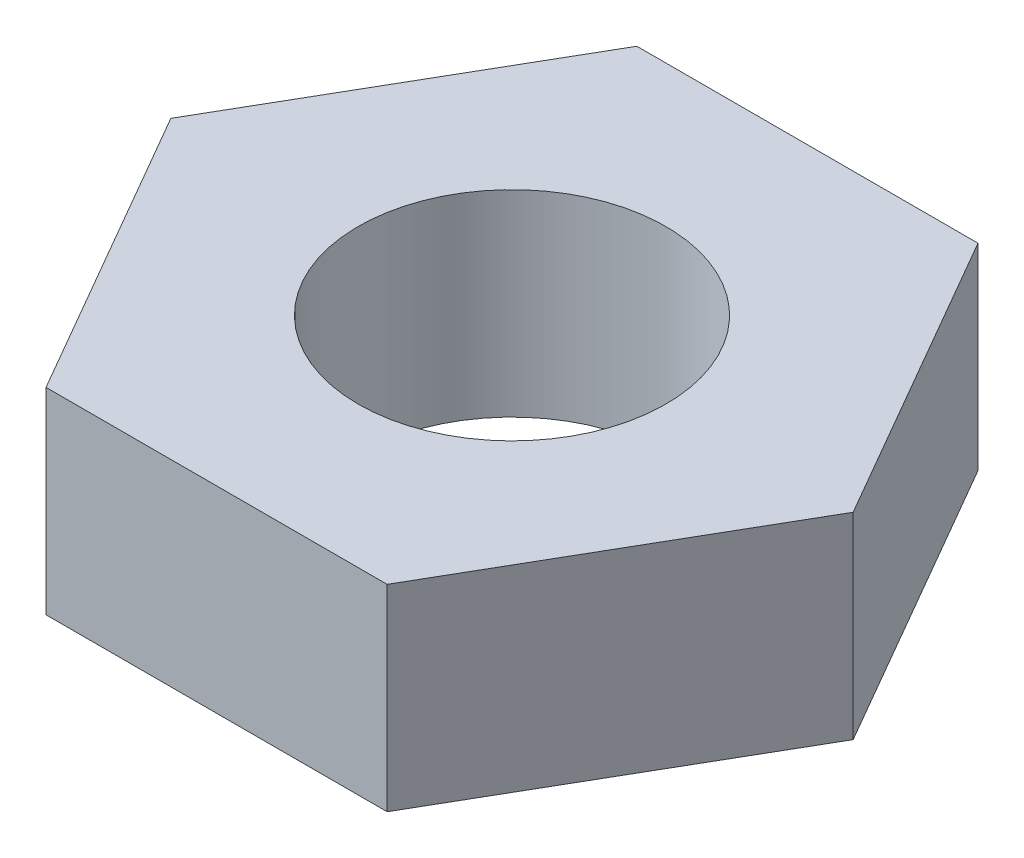
ISO-10303-21;
HEADER;
FILE_DESCRIPTION(('STEP AP214'),'2;1');
FILE_NAME('part.step','',(''),(''),'','','');
FILE_SCHEMA(('AUTOMOTIVE_DESIGN { 1 0 10303 214 1 1 1 1 }'));
ENDSEC;
DATA;
#1=APPLICATION_CONTEXT('core data for automotive mechanical design processes');
#2=APPLICATION_PROTOCOL_DEFINITION('international standard','automotive_design',2000,#1);
#3=PRODUCT_CONTEXT('',#1,'mechanical');
#4=PRODUCT('Part','Part','',(#3));
#5=PRODUCT_RELATED_PRODUCT_CATEGORY('part','',(#4));
#6=PRODUCT_DEFINITION_FORMATION('','',#4);
#7=PRODUCT_DEFINITION_CONTEXT('part definition',#1,'design');
#8=PRODUCT_DEFINITION('design','',#6,#7);
#9=PRODUCT_DEFINITION_SHAPE('','',#8);
#10=(LENGTH_UNIT() NAMED_UNIT(*) SI_UNIT(.MILLI.,.METRE.));
#11=(NAMED_UNIT(*) PLANE_ANGLE_UNIT() SI_UNIT($,.RADIAN.));
#12=(NAMED_UNIT(*) SI_UNIT($,.STERADIAN.) SOLID_ANGLE_UNIT());
#13=UNCERTAINTY_MEASURE_WITH_UNIT(LENGTH_MEASURE(1.E-05),#10,'distance_accuracy_value','');
#14=(GEOMETRIC_REPRESENTATION_CONTEXT(3) GLOBAL_UNCERTAINTY_ASSIGNED_CONTEXT((#13)) GLOBAL_UNIT_ASSIGNED_CONTEXT((#10,
#11,#12)) REPRESENTATION_CONTEXT('',''));
#15=CARTESIAN_POINT('',(0.,0.,0.));
#16=DIRECTION('',(0.,0.,1.));
#17=DIRECTION('',(1.,0.,0.));
#18=AXIS2_PLACEMENT_3D('',#15,#16,#17);
#19=CARTESIAN_POINT('',(10.9985226280624,6.35,0.));
#20=DIRECTION('',(-0.866025403784438,0.,0.5));
#21=DIRECTION('',(0.5,0.,0.866025403784438));
#22=AXIS2_PLACEMENT_3D('',#19,#20,#21);
#23=PLANE('',#22);
#24=DIRECTION('',(-0.5,0.,-0.866025403784438));
#25=VECTOR('',#24,1.);
#26=CARTESIAN_POINT('',(10.9985226280624,0.,0.));
#27=LINE('',#26,#25);
#28=CARTESIAN_POINT('',(10.9985226280624,0.,0.));
#29=VERTEX_POINT('',#28);
#30=CARTESIAN_POINT('',(5.49926131403119,0.,-9.525));
#31=VERTEX_POINT('',#30);
#32=EDGE_CURVE('E129',#29,#31,#27,.T.);
#33=ORIENTED_EDGE('',*,*,#32,.T.);
#34=DIRECTION('',(0.,-1.,0.));
#35=VECTOR('',#34,1.);
#36=CARTESIAN_POINT('',(5.49926131403119,6.35,-9.525));
#37=LINE('',#36,#35);
#38=CARTESIAN_POINT('',(5.49926131403119,6.35,-9.525));
#39=VERTEX_POINT('',#38);
#40=EDGE_CURVE('E11',#39,#31,#37,.T.);
#41=ORIENTED_EDGE('',*,*,#40,.F.);
#42=DIRECTION('',(-0.5,0.,-0.866025403784438));
#43=VECTOR('',#42,1.);
#44=CARTESIAN_POINT('',(10.9985226280624,6.35,0.));
#45=LINE('',#44,#43);
#46=CARTESIAN_POINT('',(10.9985226280624,6.35,0.));
#47=VERTEX_POINT('',#46);
#48=EDGE_CURVE('E140',#47,#39,#45,.T.);
#49=ORIENTED_EDGE('',*,*,#48,.F.);
#50=DIRECTION('',(0.,-1.,0.));
#51=VECTOR('',#50,1.);
#52=CARTESIAN_POINT('',(10.9985226280624,6.35,0.));
#53=LINE('',#52,#51);
#54=EDGE_CURVE('E125',#47,#29,#53,.T.);
#55=ORIENTED_EDGE('',*,*,#54,.T.);
#56=EDGE_LOOP('',(#33,#41,#49,#55));
#57=FACE_BOUND('',#56,.T.);
#58=ADVANCED_FACE('F45',(#57),#23,.F.);
#59=CARTESIAN_POINT('',(5.49926131403119,6.35,-9.525));
#60=DIRECTION('',(0.,0.,1.));
#61=DIRECTION('',(1.,0.,0.));
#62=AXIS2_PLACEMENT_3D('',#59,#60,#61);
#63=PLANE('',#62);
#64=DIRECTION('',(-1.,0.,0.));
#65=VECTOR('',#64,1.);
#66=CARTESIAN_POINT('',(5.49926131403119,0.,-9.525));
#67=LINE('',#66,#65);
#68=CARTESIAN_POINT('',(-5.49926131403119,0.,-9.525));
#69=VERTEX_POINT('',#68);
#70=EDGE_CURVE('E132',#31,#69,#67,.T.);
#71=ORIENTED_EDGE('',*,*,#70,.T.);
#72=DIRECTION('',(0.,-1.,0.));
#73=VECTOR('',#72,1.);
#74=CARTESIAN_POINT('',(-5.49926131403119,6.35,-9.525));
#75=LINE('',#74,#73);
#76=CARTESIAN_POINT('',(-5.49926131403119,6.35,-9.525));
#77=VERTEX_POINT('',#76);
#78=EDGE_CURVE('E53',#77,#69,#75,.T.);
#79=ORIENTED_EDGE('',*,*,#78,.F.);
#80=DIRECTION('',(-1.,0.,0.));
#81=VECTOR('',#80,1.);
#82=CARTESIAN_POINT('',(5.49926131403119,6.35,-9.525));
#83=LINE('',#82,#81);
#84=EDGE_CURVE('E98',#39,#77,#83,.T.);
#85=ORIENTED_EDGE('',*,*,#84,.F.);
#86=ORIENTED_EDGE('',*,*,#40,.T.);
#87=EDGE_LOOP('',(#71,#79,#85,#86));
#88=FACE_BOUND('',#87,.T.);
#89=ADVANCED_FACE('F165',(#88),#63,.F.);
#90=CARTESIAN_POINT('',(-5.49926131403119,6.35,-9.525));
#91=DIRECTION('',(0.866025403784439,0.,0.499999999999999));
#92=DIRECTION('',(0.499999999999999,0.,-0.866025403784439));
#93=AXIS2_PLACEMENT_3D('',#90,#91,#92);
#94=PLANE('',#93);
#95=DIRECTION('',(-0.499999999999999,0.,0.866025403784439));
#96=VECTOR('',#95,1.);
#97=CARTESIAN_POINT('',(-5.49926131403119,0.,-9.525));
#98=LINE('',#97,#96);
#99=CARTESIAN_POINT('',(-10.9985226280624,0.,0.));
#100=VERTEX_POINT('',#99);
#101=EDGE_CURVE('E135',#69,#100,#98,.T.);
#102=ORIENTED_EDGE('',*,*,#101,.T.);
#103=DIRECTION('',(0.,-1.,0.));
#104=VECTOR('',#103,1.);
#105=CARTESIAN_POINT('',(-10.9985226280624,6.35,0.));
#106=LINE('',#105,#104);
#107=CARTESIAN_POINT('',(-10.9985226280624,6.35,0.));
#108=VERTEX_POINT('',#107);
#109=EDGE_CURVE('E120',#108,#100,#106,.T.);
#110=ORIENTED_EDGE('',*,*,#109,.F.);
#111=DIRECTION('',(-0.499999999999999,0.,0.866025403784439));
#112=VECTOR('',#111,1.);
#113=CARTESIAN_POINT('',(-5.49926131403119,6.35,-9.525));
#114=LINE('',#113,#112);
#115=EDGE_CURVE('E111',#77,#108,#114,.T.);
#116=ORIENTED_EDGE('',*,*,#115,.F.);
#117=ORIENTED_EDGE('',*,*,#78,.T.);
#118=EDGE_LOOP('',(#102,#110,#116,#117));
#119=FACE_BOUND('',#118,.T.);
#120=ADVANCED_FACE('F146',(#119),#94,.F.);
#121=CARTESIAN_POINT('',(-10.9985226280624,6.35,0.));
#122=DIRECTION('',(0.866025403784438,0.,-0.5));
#123=DIRECTION('',(-0.5,0.,-0.866025403784438));
#124=AXIS2_PLACEMENT_3D('',#121,#122,#123);
#125=PLANE('',#124);
#126=DIRECTION('',(0.5,0.,0.866025403784438));
#127=VECTOR('',#126,1.);
#128=CARTESIAN_POINT('',(-10.9985226280624,0.,0.));
#129=LINE('',#128,#127);
#130=CARTESIAN_POINT('',(-5.49926131403118,0.,9.525));
#131=VERTEX_POINT('',#130);
#132=EDGE_CURVE('E119',#100,#131,#129,.T.);
#133=ORIENTED_EDGE('',*,*,#132,.T.);
#134=DIRECTION('',(0.,-1.,0.));
#135=VECTOR('',#134,1.);
#136=CARTESIAN_POINT('',(-5.49926131403118,6.35,9.525));
#137=LINE('',#136,#135);
#138=CARTESIAN_POINT('',(-5.49926131403118,6.35,9.525));
#139=VERTEX_POINT('',#138);
#140=EDGE_CURVE('E116',#139,#131,#137,.T.);
#141=ORIENTED_EDGE('',*,*,#140,.F.);
#142=DIRECTION('',(0.5,0.,0.866025403784438));
#143=VECTOR('',#142,1.);
#144=CARTESIAN_POINT('',(-10.9985226280624,6.35,0.));
#145=LINE('',#144,#143);
#146=EDGE_CURVE('E105',#108,#139,#145,.T.);
#147=ORIENTED_EDGE('',*,*,#146,.F.);
#148=ORIENTED_EDGE('',*,*,#109,.T.);
#149=EDGE_LOOP('',(#133,#141,#147,#148));
#150=FACE_BOUND('',#149,.T.);
#151=ADVANCED_FACE('F117',(#150),#125,.F.);
#152=CARTESIAN_POINT('',(-5.49926131403118,6.35,9.525));
#153=DIRECTION('',(0.,0.,-1.));
#154=DIRECTION('',(-1.,0.,0.));
#155=AXIS2_PLACEMENT_3D('',#152,#153,#154);
#156=PLANE('',#155);
#157=DIRECTION('',(1.,0.,0.));
#158=VECTOR('',#157,1.);
#159=CARTESIAN_POINT('',(-5.49926131403118,0.,9.525));
#160=LINE('',#159,#158);
#161=CARTESIAN_POINT('',(5.49926131403119,0.,9.525));
#162=VERTEX_POINT('',#161);
#163=EDGE_CURVE('E84',#131,#162,#160,.T.);
#164=ORIENTED_EDGE('',*,*,#163,.T.);
#165=DIRECTION('',(0.,-1.,0.));
#166=VECTOR('',#165,1.);
#167=CARTESIAN_POINT('',(5.49926131403119,6.35,9.525));
#168=LINE('',#167,#166);
#169=CARTESIAN_POINT('',(5.49926131403119,6.35,9.525));
#170=VERTEX_POINT('',#169);
#171=EDGE_CURVE('E121',#170,#162,#168,.T.);
#172=ORIENTED_EDGE('',*,*,#171,.F.);
#173=DIRECTION('',(1.,0.,0.));
#174=VECTOR('',#173,1.);
#175=CARTESIAN_POINT('',(-5.49926131403118,6.35,9.525));
#176=LINE('',#175,#174);
#177=EDGE_CURVE('E109',#139,#170,#176,.T.);
#178=ORIENTED_EDGE('',*,*,#177,.F.);
#179=ORIENTED_EDGE('',*,*,#140,.T.);
#180=EDGE_LOOP('',(#164,#172,#178,#179));
#181=FACE_BOUND('',#180,.T.);
#182=ADVANCED_FACE('F123',(#181),#156,.F.);
#183=CARTESIAN_POINT('',(5.49926131403119,6.35,9.525));
#184=DIRECTION('',(-0.866025403784439,0.,-0.5));
#185=DIRECTION('',(-0.5,0.,0.866025403784439));
#186=AXIS2_PLACEMENT_3D('',#183,#184,#185);
#187=PLANE('',#186);
#188=DIRECTION('',(0.5,0.,-0.866025403784439));
#189=VECTOR('',#188,1.);
#190=CARTESIAN_POINT('',(5.49926131403119,0.,9.525));
#191=LINE('',#190,#189);
#192=EDGE_CURVE('E90',#162,#29,#191,.T.);
#193=ORIENTED_EDGE('',*,*,#192,.T.);
#194=ORIENTED_EDGE('',*,*,#54,.F.);
#195=DIRECTION('',(0.5,0.,-0.866025403784439));
#196=VECTOR('',#195,1.);
#197=CARTESIAN_POINT('',(5.49926131403119,6.35,9.525));
#198=LINE('',#197,#196);
#199=EDGE_CURVE('E61',#170,#47,#198,.T.);
#200=ORIENTED_EDGE('',*,*,#199,.F.);
#201=ORIENTED_EDGE('',*,*,#171,.T.);
#202=EDGE_LOOP('',(#193,#194,#200,#201));
#203=FACE_BOUND('',#202,.T.);
#204=ADVANCED_FACE('F153',(#203),#187,.F.);
#205=CARTESIAN_POINT('',(0.,6.35,0.));
#206=DIRECTION('',(0.,1.,0.));
#207=DIRECTION('',(0.,0.,1.));
#208=AXIS2_PLACEMENT_3D('',#205,#206,#207);
#209=PLANE('',#208);
#210=CARTESIAN_POINT('',(0.,6.35,0.));
#211=DIRECTION('',(0.,1.,0.));
#212=DIRECTION('',(0.,0.,1.));
#213=AXIS2_PLACEMENT_3D('',#210,#211,#212);
#214=CIRCLE('',#213,4.96061999999999);
#215=CARTESIAN_POINT('',(0.,6.35,4.96061999999999));
#216=VERTEX_POINT('',#215);
#217=EDGE_CURVE('E225',#216,#216,#214,.T.);
#218=ORIENTED_EDGE('',*,*,#217,.F.);
#219=EDGE_LOOP('',(#218));
#220=FACE_BOUND('',#219,.T.);
#221=ORIENTED_EDGE('',*,*,#48,.T.);
#222=ORIENTED_EDGE('',*,*,#84,.T.);
#223=ORIENTED_EDGE('',*,*,#115,.T.);
#224=ORIENTED_EDGE('',*,*,#146,.T.);
#225=ORIENTED_EDGE('',*,*,#177,.T.);
#226=ORIENTED_EDGE('',*,*,#199,.T.);
#227=EDGE_LOOP('',(#221,#222,#223,#224,#225,#226));
#228=FACE_BOUND('',#227,.T.);
#229=ADVANCED_FACE('F107',(#220,#228),#209,.T.);
#230=CARTESIAN_POINT('',(0.,0.,0.));
#231=DIRECTION('',(0.,1.,0.));
#232=DIRECTION('',(0.,0.,1.));
#233=AXIS2_PLACEMENT_3D('',#230,#231,#232);
#234=PLANE('',#233);
#235=CARTESIAN_POINT('',(0.,0.,0.));
#236=DIRECTION('',(0.,1.,0.));
#237=DIRECTION('',(0.,0.,1.));
#238=AXIS2_PLACEMENT_3D('',#235,#236,#237);
#239=CIRCLE('',#238,4.96062);
#240=CARTESIAN_POINT('',(0.,0.,4.96062));
#241=VERTEX_POINT('',#240);
#242=EDGE_CURVE('E133',#241,#241,#239,.T.);
#243=ORIENTED_EDGE('',*,*,#242,.T.);
#244=EDGE_LOOP('',(#243));
#245=FACE_BOUND('',#244,.T.);
#246=ORIENTED_EDGE('',*,*,#32,.F.);
#247=ORIENTED_EDGE('',*,*,#192,.F.);
#248=ORIENTED_EDGE('',*,*,#163,.F.);
#249=ORIENTED_EDGE('',*,*,#132,.F.);
#250=ORIENTED_EDGE('',*,*,#101,.F.);
#251=ORIENTED_EDGE('',*,*,#70,.F.);
#252=EDGE_LOOP('',(#246,#247,#248,#249,#250,#251));
#253=FACE_BOUND('',#252,.T.);
#254=ADVANCED_FACE('F149',(#245,#253),#234,.F.);
#255=CARTESIAN_POINT('',(0.,6.35,0.));
#256=DIRECTION('',(0.,1.,0.));
#257=DIRECTION('',(0.,0.,1.));
#258=AXIS2_PLACEMENT_3D('',#255,#256,#257);
#259=CYLINDRICAL_SURFACE('',#258,4.96061999999999);
#260=ORIENTED_EDGE('',*,*,#242,.F.);
#261=EDGE_LOOP('',(#260));
#262=FACE_BOUND('',#261,.T.);
#263=ORIENTED_EDGE('',*,*,#217,.T.);
#264=EDGE_LOOP('',(#263));
#265=FACE_BOUND('',#264,.T.);
#266=ADVANCED_FACE('F204',(#262,#265),#259,.F.);
#267=CLOSED_SHELL('',(#58,#89,#120,#151,#182,#204,#229,#254,#266));
#268=MANIFOLD_SOLID_BREP('B2',#267);
#269=ADVANCED_BREP_SHAPE_REPRESENTATION('',(#18,#268),#14);
#270=SHAPE_DEFINITION_REPRESENTATION(#9,#269);
ENDSEC;
END-ISO-10303-21;
